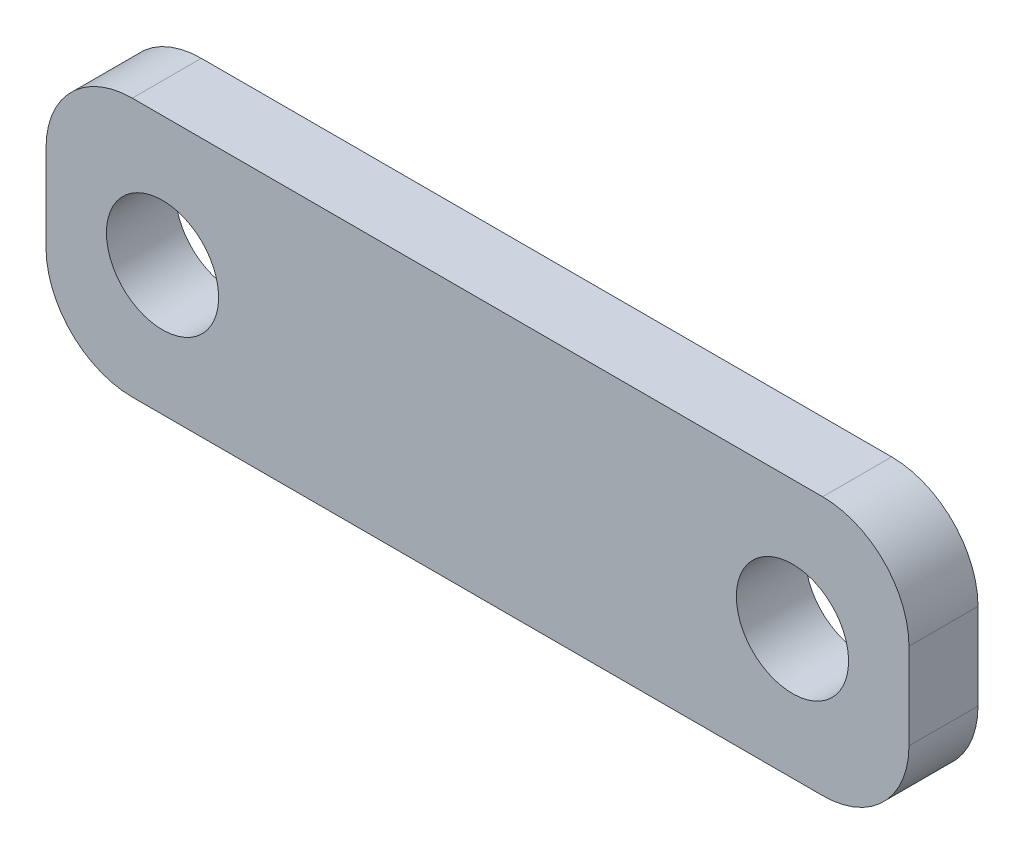
ISO-10303-21;
HEADER;
FILE_DESCRIPTION(('STEP AP214'),'2;1');
FILE_NAME('part.step','',(''),(''),'','','');
FILE_SCHEMA(('AUTOMOTIVE_DESIGN { 1 0 10303 214 1 1 1 1 }'));
ENDSEC;
DATA;
#1=APPLICATION_CONTEXT('core data for automotive mechanical design processes');
#2=APPLICATION_PROTOCOL_DEFINITION('international standard','automotive_design',2000,#1);
#3=PRODUCT_CONTEXT('',#1,'mechanical');
#4=PRODUCT('Part','Part','',(#3));
#5=PRODUCT_RELATED_PRODUCT_CATEGORY('part','',(#4));
#6=PRODUCT_DEFINITION_FORMATION('','',#4);
#7=PRODUCT_DEFINITION_CONTEXT('part definition',#1,'design');
#8=PRODUCT_DEFINITION('design','',#6,#7);
#9=PRODUCT_DEFINITION_SHAPE('','',#8);
#10=(LENGTH_UNIT() NAMED_UNIT(*) SI_UNIT(.MILLI.,.METRE.));
#11=(NAMED_UNIT(*) PLANE_ANGLE_UNIT() SI_UNIT($,.RADIAN.));
#12=(NAMED_UNIT(*) SI_UNIT($,.STERADIAN.) SOLID_ANGLE_UNIT());
#13=UNCERTAINTY_MEASURE_WITH_UNIT(LENGTH_MEASURE(1.E-05),#10,'distance_accuracy_value','');
#14=(GEOMETRIC_REPRESENTATION_CONTEXT(3) GLOBAL_UNCERTAINTY_ASSIGNED_CONTEXT((#13)) GLOBAL_UNIT_ASSIGNED_CONTEXT((#10,
#11,#12)) REPRESENTATION_CONTEXT('',''));
#15=CARTESIAN_POINT('',(0.,0.,0.));
#16=DIRECTION('',(0.,0.,1.));
#17=DIRECTION('',(1.,0.,0.));
#18=AXIS2_PLACEMENT_3D('',#15,#16,#17);
#19=CARTESIAN_POINT('',(-50.0000000000001,-14.9999999999997,4.00000000000005));
#20=DIRECTION('',(0.,1.,0.));
#21=DIRECTION('',(0.,0.,1.));
#22=AXIS2_PLACEMENT_3D('',#19,#20,#21);
#23=PLANE('',#22);
#24=DIRECTION('',(1.,0.,0.));
#25=VECTOR('',#24,1.);
#26=CARTESIAN_POINT('',(-50.0000000000001,-14.9999999999997,-3.99999999999996));
#27=LINE('',#26,#25);
#28=CARTESIAN_POINT('',(-40.,-14.9999999999997,-3.99999999999997));
#29=VERTEX_POINT('',#28);
#30=CARTESIAN_POINT('',(40.0000000000003,-14.9999999999997,-4.00000000000003));
#31=VERTEX_POINT('',#30);
#32=EDGE_CURVE('E127',#29,#31,#27,.T.);
#33=ORIENTED_EDGE('',*,*,#32,.T.);
#34=DIRECTION('',(0.,0.,1.));
#35=VECTOR('',#34,1.);
#36=CARTESIAN_POINT('',(40.0000000000001,-14.9999999999997,3.99999999999998));
#37=LINE('',#36,#35);
#38=CARTESIAN_POINT('',(40.0000000000003,-14.9999999999997,3.99999999999998));
#39=VERTEX_POINT('',#38);
#40=EDGE_CURVE('E11',#31,#39,#37,.T.);
#41=ORIENTED_EDGE('',*,*,#40,.T.);
#42=DIRECTION('',(1.,0.,0.));
#43=VECTOR('',#42,1.);
#44=CARTESIAN_POINT('',(-50.0000000000001,-14.9999999999997,4.00000000000005));
#45=LINE('',#44,#43);
#46=CARTESIAN_POINT('',(-40.,-14.9999999999997,4.00000000000004));
#47=VERTEX_POINT('',#46);
#48=EDGE_CURVE('E132',#47,#39,#45,.T.);
#49=ORIENTED_EDGE('',*,*,#48,.F.);
#50=DIRECTION('',(0.,0.,1.));
#51=VECTOR('',#50,1.);
#52=CARTESIAN_POINT('',(-40.,-14.9999999999997,4.00000000000004));
#53=LINE('',#52,#51);
#54=EDGE_CURVE('E46',#47,#29,#53,.F.);
#55=ORIENTED_EDGE('',*,*,#54,.T.);
#56=EDGE_LOOP('',(#33,#41,#49,#55));
#57=FACE_BOUND('',#56,.T.);
#58=ADVANCED_FACE('F38',(#57),#23,.F.);
#59=CARTESIAN_POINT('',(-50.0000000000001,-14.9999999999997,4.00000000000005));
#60=DIRECTION('',(0.,0.,-1.));
#61=DIRECTION('',(-1.,0.,0.));
#62=AXIS2_PLACEMENT_3D('',#59,#60,#61);
#63=PLANE('',#62);
#64=CARTESIAN_POINT('',(-36.5000000000001,8.88178419700125E-13,4.00000000000002));
#65=DIRECTION('',(0.,0.,-1.));
#66=DIRECTION('',(-1.,0.,0.));
#67=AXIS2_PLACEMENT_3D('',#64,#65,#66);
#68=CIRCLE('',#67,6.5);
#69=CARTESIAN_POINT('',(-43.0000000000001,8.86989855055765E-13,4.00000000000002));
#70=VERTEX_POINT('',#69);
#71=EDGE_CURVE('E323',#70,#70,#68,.T.);
#72=ORIENTED_EDGE('',*,*,#71,.T.);
#73=EDGE_LOOP('',(#72));
#74=FACE_BOUND('',#73,.T.);
#75=CARTESIAN_POINT('',(36.5,-8.91647866652079E-13,3.99999999999999));
#76=DIRECTION('',(0.,0.,-1.));
#77=DIRECTION('',(-1.,0.,0.));
#78=AXIS2_PLACEMENT_3D('',#75,#76,#77);
#79=CIRCLE('',#78,6.5);
#80=CARTESIAN_POINT('',(30.,-8.92836431296439E-13,3.99999999999999));
#81=VERTEX_POINT('',#80);
#82=EDGE_CURVE('E183',#81,#81,#79,.T.);
#83=ORIENTED_EDGE('',*,*,#82,.T.);
#84=EDGE_LOOP('',(#83));
#85=FACE_BOUND('',#84,.T.);
#86=DIRECTION('',(0.,1.,0.));
#87=VECTOR('',#86,1.);
#88=CARTESIAN_POINT('',(50.0000000000001,-15.000000000001,3.99999999999998));
#89=LINE('',#88,#87);
#90=CARTESIAN_POINT('',(50.0000000000001,-4.99999999999969,3.99999999999998));
#91=VERTEX_POINT('',#90);
#92=CARTESIAN_POINT('',(50.0000000000001,5.00000000000013,3.99999999999998));
#93=VERTEX_POINT('',#92);
#94=EDGE_CURVE('E180',#91,#93,#89,.T.);
#95=ORIENTED_EDGE('',*,*,#94,.T.);
#96=CARTESIAN_POINT('',(40.0000000000001,5.00000000000011,4.00000000000006));
#97=DIRECTION('',(0.,0.,-1.));
#98=DIRECTION('',(-1.,0.,0.));
#99=AXIS2_PLACEMENT_3D('',#96,#97,#98);
#100=CIRCLE('',#99,10.);
#101=CARTESIAN_POINT('',(40.0000000000003,15.0000000000001,3.99999999999999));
#102=VERTEX_POINT('',#101);
#103=EDGE_CURVE('E150',#93,#102,#100,.F.);
#104=ORIENTED_EDGE('',*,*,#103,.T.);
#105=DIRECTION('',(1.,0.,0.));
#106=VECTOR('',#105,1.);
#107=CARTESIAN_POINT('',(-50.,15.0000000000001,4.00000000000006));
#108=LINE('',#107,#106);
#109=CARTESIAN_POINT('',(-40.,15.0000000000001,4.00000000000005));
#110=VERTEX_POINT('',#109);
#111=EDGE_CURVE('E126',#110,#102,#108,.T.);
#112=ORIENTED_EDGE('',*,*,#111,.F.);
#113=CARTESIAN_POINT('',(-40.,5.00000000000012,4.00000000000005));
#114=DIRECTION('',(0.,0.,-1.));
#115=DIRECTION('',(-1.,0.,0.));
#116=AXIS2_PLACEMENT_3D('',#113,#114,#115);
#117=CIRCLE('',#116,10.);
#118=CARTESIAN_POINT('',(-50.0000000000001,5.00000000000014,4.00000000000005));
#119=VERTEX_POINT('',#118);
#120=EDGE_CURVE('E131',#110,#119,#117,.F.);
#121=ORIENTED_EDGE('',*,*,#120,.T.);
#122=DIRECTION('',(0.,1.,0.));
#123=VECTOR('',#122,1.);
#124=CARTESIAN_POINT('',(-50.0000000000001,-14.9999999999997,4.00000000000005));
#125=LINE('',#124,#123);
#126=CARTESIAN_POINT('',(-50.0000000000001,-4.99999999999968,4.00000000000005));
#127=VERTEX_POINT('',#126);
#128=EDGE_CURVE('E170',#127,#119,#125,.T.);
#129=ORIENTED_EDGE('',*,*,#128,.F.);
#130=CARTESIAN_POINT('',(-40.,-4.99999999999969,4.00000000000005));
#131=DIRECTION('',(0.,0.,-1.));
#132=DIRECTION('',(-1.,0.,0.));
#133=AXIS2_PLACEMENT_3D('',#130,#131,#132);
#134=CIRCLE('',#133,10.);
#135=EDGE_CURVE('E60',#127,#47,#134,.F.);
#136=ORIENTED_EDGE('',*,*,#135,.T.);
#137=ORIENTED_EDGE('',*,*,#48,.T.);
#138=CARTESIAN_POINT('',(40.0000000000001,-4.99999999999971,4.00000000000006));
#139=DIRECTION('',(0.,0.,-1.));
#140=DIRECTION('',(-1.,0.,0.));
#141=AXIS2_PLACEMENT_3D('',#138,#139,#140);
#142=CIRCLE('',#141,10.);
#143=EDGE_CURVE('E53',#39,#91,#142,.F.);
#144=ORIENTED_EDGE('',*,*,#143,.T.);
#145=EDGE_LOOP('',(#95,#104,#112,#121,#129,#136,#137,#144));
#146=FACE_BOUND('',#145,.T.);
#147=ADVANCED_FACE('F172',(#74,#85,#146),#63,.F.);
#148=CARTESIAN_POINT('',(-50.,15.0000000000001,-3.99999999999995));
#149=DIRECTION('',(0.,-1.,0.));
#150=DIRECTION('',(0.,0.,-1.));
#151=AXIS2_PLACEMENT_3D('',#148,#149,#150);
#152=PLANE('',#151);
#153=ORIENTED_EDGE('',*,*,#111,.T.);
#154=DIRECTION('',(0.,0.,-1.));
#155=VECTOR('',#154,1.);
#156=CARTESIAN_POINT('',(40.0000000000001,15.0000000000001,-4.00000000000001));
#157=LINE('',#156,#155);
#158=CARTESIAN_POINT('',(40.0000000000003,15.0000000000001,-4.00000000000002));
#159=VERTEX_POINT('',#158);
#160=EDGE_CURVE('E124',#102,#159,#157,.T.);
#161=ORIENTED_EDGE('',*,*,#160,.T.);
#162=DIRECTION('',(1.,0.,0.));
#163=VECTOR('',#162,1.);
#164=CARTESIAN_POINT('',(-50.,15.0000000000001,-3.99999999999995));
#165=LINE('',#164,#163);
#166=CARTESIAN_POINT('',(-40.,15.0000000000001,-3.99999999999996));
#167=VERTEX_POINT('',#166);
#168=EDGE_CURVE('E107',#167,#159,#165,.T.);
#169=ORIENTED_EDGE('',*,*,#168,.F.);
#170=DIRECTION('',(0.,0.,-1.));
#171=VECTOR('',#170,1.);
#172=CARTESIAN_POINT('',(-40.,15.0000000000001,-3.99999999999995));
#173=LINE('',#172,#171);
#174=EDGE_CURVE('E121',#167,#110,#173,.F.);
#175=ORIENTED_EDGE('',*,*,#174,.T.);
#176=EDGE_LOOP('',(#153,#161,#169,#175));
#177=FACE_BOUND('',#176,.T.);
#178=ADVANCED_FACE('F120',(#177),#152,.F.);
#179=CARTESIAN_POINT('',(-50.0000000000001,-14.9999999999997,-3.99999999999996));
#180=DIRECTION('',(0.,0.,1.));
#181=DIRECTION('',(1.,0.,0.));
#182=AXIS2_PLACEMENT_3D('',#179,#180,#181);
#183=PLANE('',#182);
#184=CARTESIAN_POINT('',(-36.5,1.77635683940025E-12,-3.99999999999993));
#185=DIRECTION('',(0.,0.,-1.));
#186=DIRECTION('',(-1.,0.,0.));
#187=AXIS2_PLACEMENT_3D('',#184,#185,#186);
#188=CIRCLE('',#187,6.5);
#189=CARTESIAN_POINT('',(-43.,1.77516827475589E-12,-3.99999999999993));
#190=VERTEX_POINT('',#189);
#191=EDGE_CURVE('E319',#190,#190,#188,.T.);
#192=ORIENTED_EDGE('',*,*,#191,.F.);
#193=EDGE_LOOP('',(#192));
#194=FACE_BOUND('',#193,.T.);
#195=CARTESIAN_POINT('',(36.5000000000001,0.,-3.99999999999996));
#196=DIRECTION('',(0.,0.,-1.));
#197=DIRECTION('',(-1.,0.,0.));
#198=AXIS2_PLACEMENT_3D('',#195,#196,#197);
#199=CIRCLE('',#198,6.5);
#200=CARTESIAN_POINT('',(30.0000000000001,0.,-3.99999999999996));
#201=VERTEX_POINT('',#200);
#202=EDGE_CURVE('E322',#201,#201,#199,.T.);
#203=ORIENTED_EDGE('',*,*,#202,.F.);
#204=EDGE_LOOP('',(#203));
#205=FACE_BOUND('',#204,.T.);
#206=ORIENTED_EDGE('',*,*,#168,.T.);
#207=CARTESIAN_POINT('',(40.0000000000001,5.00000000000011,-3.99999999999995));
#208=DIRECTION('',(0.,0.,1.));
#209=DIRECTION('',(1.,0.,0.));
#210=AXIS2_PLACEMENT_3D('',#207,#208,#209);
#211=CIRCLE('',#210,10.);
#212=CARTESIAN_POINT('',(50.0000000000001,5.00000000000013,-4.00000000000003));
#213=VERTEX_POINT('',#212);
#214=EDGE_CURVE('E114',#159,#213,#211,.F.);
#215=ORIENTED_EDGE('',*,*,#214,.T.);
#216=DIRECTION('',(0.,-1.,0.));
#217=VECTOR('',#216,1.);
#218=CARTESIAN_POINT('',(50.0000000000001,-15.000000000001,-4.00000000000003));
#219=LINE('',#218,#217);
#220=CARTESIAN_POINT('',(50.0000000000001,-4.99999999999969,-4.00000000000003));
#221=VERTEX_POINT('',#220);
#222=EDGE_CURVE('E174',#213,#221,#219,.T.);
#223=ORIENTED_EDGE('',*,*,#222,.T.);
#224=CARTESIAN_POINT('',(40.0000000000001,-4.99999999999971,-3.99999999999995));
#225=DIRECTION('',(0.,0.,1.));
#226=DIRECTION('',(1.,0.,0.));
#227=AXIS2_PLACEMENT_3D('',#224,#225,#226);
#228=CIRCLE('',#227,10.);
#229=EDGE_CURVE('E115',#221,#31,#228,.F.);
#230=ORIENTED_EDGE('',*,*,#229,.T.);
#231=ORIENTED_EDGE('',*,*,#32,.F.);
#232=CARTESIAN_POINT('',(-40.,-4.99999999999969,-3.99999999999996));
#233=DIRECTION('',(0.,0.,1.));
#234=DIRECTION('',(1.,0.,0.));
#235=AXIS2_PLACEMENT_3D('',#232,#233,#234);
#236=CIRCLE('',#235,10.);
#237=CARTESIAN_POINT('',(-50.0000000000001,-4.99999999999968,-3.99999999999996));
#238=VERTEX_POINT('',#237);
#239=EDGE_CURVE('E134',#29,#238,#236,.F.);
#240=ORIENTED_EDGE('',*,*,#239,.T.);
#241=DIRECTION('',(0.,-1.,0.));
#242=VECTOR('',#241,1.);
#243=CARTESIAN_POINT('',(-50.0000000000001,-14.9999999999997,-3.99999999999996));
#244=LINE('',#243,#242);
#245=CARTESIAN_POINT('',(-50.0000000000001,5.00000000000014,-3.99999999999996));
#246=VERTEX_POINT('',#245);
#247=EDGE_CURVE('E109',#246,#238,#244,.T.);
#248=ORIENTED_EDGE('',*,*,#247,.F.);
#249=CARTESIAN_POINT('',(-40.,5.00000000000012,-3.99999999999996));
#250=DIRECTION('',(0.,0.,1.));
#251=DIRECTION('',(1.,0.,0.));
#252=AXIS2_PLACEMENT_3D('',#249,#250,#251);
#253=CIRCLE('',#252,10.);
#254=EDGE_CURVE('E104',#246,#167,#253,.F.);
#255=ORIENTED_EDGE('',*,*,#254,.T.);
#256=EDGE_LOOP('',(#206,#215,#223,#230,#231,#240,#248,#255));
#257=FACE_BOUND('',#256,.T.);
#258=ADVANCED_FACE('F106',(#194,#205,#257),#183,.F.);
#259=CARTESIAN_POINT('',(-50.,0.,0.));
#260=DIRECTION('',(1.,0.,0.));
#261=DIRECTION('',(0.,0.,-1.));
#262=AXIS2_PLACEMENT_3D('',#259,#260,#261);
#263=PLANE('',#262);
#264=ORIENTED_EDGE('',*,*,#128,.T.);
#265=DIRECTION('',(0.,0.,-1.));
#266=VECTOR('',#265,1.);
#267=CARTESIAN_POINT('',(-50.,5.00000000000012,0.));
#268=LINE('',#267,#266);
#269=EDGE_CURVE('E155',#119,#246,#268,.T.);
#270=ORIENTED_EDGE('',*,*,#269,.T.);
#271=ORIENTED_EDGE('',*,*,#247,.T.);
#272=DIRECTION('',(0.,0.,1.));
#273=VECTOR('',#272,1.);
#274=CARTESIAN_POINT('',(-50.,-4.99999999999969,0.));
#275=LINE('',#274,#273);
#276=EDGE_CURVE('E152',#238,#127,#275,.T.);
#277=ORIENTED_EDGE('',*,*,#276,.T.);
#278=EDGE_LOOP('',(#264,#270,#271,#277));
#279=FACE_BOUND('',#278,.T.);
#280=ADVANCED_FACE('F169',(#279),#263,.F.);
#281=CARTESIAN_POINT('',(50.0000000000001,-8.91647866652079E-13,0.));
#282=DIRECTION('',(1.,0.,0.));
#283=DIRECTION('',(0.,0.,-1.));
#284=AXIS2_PLACEMENT_3D('',#281,#282,#283);
#285=PLANE('',#284);
#286=ORIENTED_EDGE('',*,*,#222,.F.);
#287=DIRECTION('',(0.,0.,-1.));
#288=VECTOR('',#287,1.);
#289=CARTESIAN_POINT('',(50.0000000000001,5.00000000000011,3.99999999999998));
#290=LINE('',#289,#288);
#291=EDGE_CURVE('E145',#213,#93,#290,.F.);
#292=ORIENTED_EDGE('',*,*,#291,.T.);
#293=ORIENTED_EDGE('',*,*,#94,.F.);
#294=DIRECTION('',(0.,0.,1.));
#295=VECTOR('',#294,1.);
#296=CARTESIAN_POINT('',(50.0000000000001,-4.9999999999997,-4.00000000000003));
#297=LINE('',#296,#295);
#298=EDGE_CURVE('E143',#91,#221,#297,.F.);
#299=ORIENTED_EDGE('',*,*,#298,.T.);
#300=EDGE_LOOP('',(#286,#292,#293,#299));
#301=FACE_BOUND('',#300,.T.);
#302=ADVANCED_FACE('F196',(#301),#285,.T.);
#303=CARTESIAN_POINT('',(36.5000000000001,0.,-3.99999999999996));
#304=DIRECTION('',(0.,0.,-1.));
#305=DIRECTION('',(-1.,0.,0.));
#306=AXIS2_PLACEMENT_3D('',#303,#304,#305);
#307=CYLINDRICAL_SURFACE('',#306,6.5);
#308=ORIENTED_EDGE('',*,*,#202,.T.);
#309=EDGE_LOOP('',(#308));
#310=FACE_BOUND('',#309,.T.);
#311=ORIENTED_EDGE('',*,*,#82,.F.);
#312=EDGE_LOOP('',(#311));
#313=FACE_BOUND('',#312,.T.);
#314=ADVANCED_FACE('F219',(#310,#313),#307,.F.);
#315=CARTESIAN_POINT('',(-36.5,1.77635683940025E-12,-3.99999999999993));
#316=DIRECTION('',(0.,0.,-1.));
#317=DIRECTION('',(-1.,0.,0.));
#318=AXIS2_PLACEMENT_3D('',#315,#316,#317);
#319=CYLINDRICAL_SURFACE('',#318,6.5);
#320=ORIENTED_EDGE('',*,*,#191,.T.);
#321=EDGE_LOOP('',(#320));
#322=FACE_BOUND('',#321,.T.);
#323=ORIENTED_EDGE('',*,*,#71,.F.);
#324=EDGE_LOOP('',(#323));
#325=FACE_BOUND('',#324,.T.);
#326=ADVANCED_FACE('F215',(#322,#325),#319,.F.);
#327=CARTESIAN_POINT('',(40.0000000000001,5.00000000000011,-3.99999999999999));
#328=DIRECTION('',(0.,0.,1.));
#329=DIRECTION('',(1.,0.,0.));
#330=AXIS2_PLACEMENT_3D('',#327,#328,#329);
#331=CYLINDRICAL_SURFACE('',#330,10.);
#332=ORIENTED_EDGE('',*,*,#103,.F.);
#333=ORIENTED_EDGE('',*,*,#291,.F.);
#334=ORIENTED_EDGE('',*,*,#214,.F.);
#335=ORIENTED_EDGE('',*,*,#160,.F.);
#336=EDGE_LOOP('',(#332,#333,#334,#335));
#337=FACE_BOUND('',#336,.T.);
#338=ADVANCED_FACE('F192',(#337),#331,.T.);
#339=CARTESIAN_POINT('',(-40.,5.00000000000012,0.));
#340=DIRECTION('',(0.,0.,-1.));
#341=DIRECTION('',(-1.,0.,0.));
#342=AXIS2_PLACEMENT_3D('',#339,#340,#341);
#343=CYLINDRICAL_SURFACE('',#342,10.);
#344=ORIENTED_EDGE('',*,*,#120,.F.);
#345=ORIENTED_EDGE('',*,*,#174,.F.);
#346=ORIENTED_EDGE('',*,*,#254,.F.);
#347=ORIENTED_EDGE('',*,*,#269,.F.);
#348=EDGE_LOOP('',(#344,#345,#346,#347));
#349=FACE_BOUND('',#348,.T.);
#350=ADVANCED_FACE('F130',(#349),#343,.T.);
#351=CARTESIAN_POINT('',(40.0000000000001,-4.99999999999971,4.00000000000001));
#352=DIRECTION('',(0.,0.,-1.));
#353=DIRECTION('',(-1.,0.,0.));
#354=AXIS2_PLACEMENT_3D('',#351,#352,#353);
#355=CYLINDRICAL_SURFACE('',#354,10.);
#356=ORIENTED_EDGE('',*,*,#229,.F.);
#357=ORIENTED_EDGE('',*,*,#298,.F.);
#358=ORIENTED_EDGE('',*,*,#143,.F.);
#359=ORIENTED_EDGE('',*,*,#40,.F.);
#360=EDGE_LOOP('',(#356,#357,#358,#359));
#361=FACE_BOUND('',#360,.T.);
#362=ADVANCED_FACE('F198',(#361),#355,.T.);
#363=CARTESIAN_POINT('',(-40.,-4.99999999999969,0.));
#364=DIRECTION('',(0.,0.,1.));
#365=DIRECTION('',(1.,0.,0.));
#366=AXIS2_PLACEMENT_3D('',#363,#364,#365);
#367=CYLINDRICAL_SURFACE('',#366,10.);
#368=ORIENTED_EDGE('',*,*,#239,.F.);
#369=ORIENTED_EDGE('',*,*,#54,.F.);
#370=ORIENTED_EDGE('',*,*,#135,.F.);
#371=ORIENTED_EDGE('',*,*,#276,.F.);
#372=EDGE_LOOP('',(#368,#369,#370,#371));
#373=FACE_BOUND('',#372,.T.);
#374=ADVANCED_FACE('F40',(#373),#367,.T.);
#375=CLOSED_SHELL('',(#58,#147,#178,#258,#280,#302,#314,#326,#338,#350,#362,#374));
#376=MANIFOLD_SOLID_BREP('B2',#375);
#377=ADVANCED_BREP_SHAPE_REPRESENTATION('',(#18,#376),#14);
#378=SHAPE_DEFINITION_REPRESENTATION(#9,#377);
ENDSEC;
END-ISO-10303-21;
